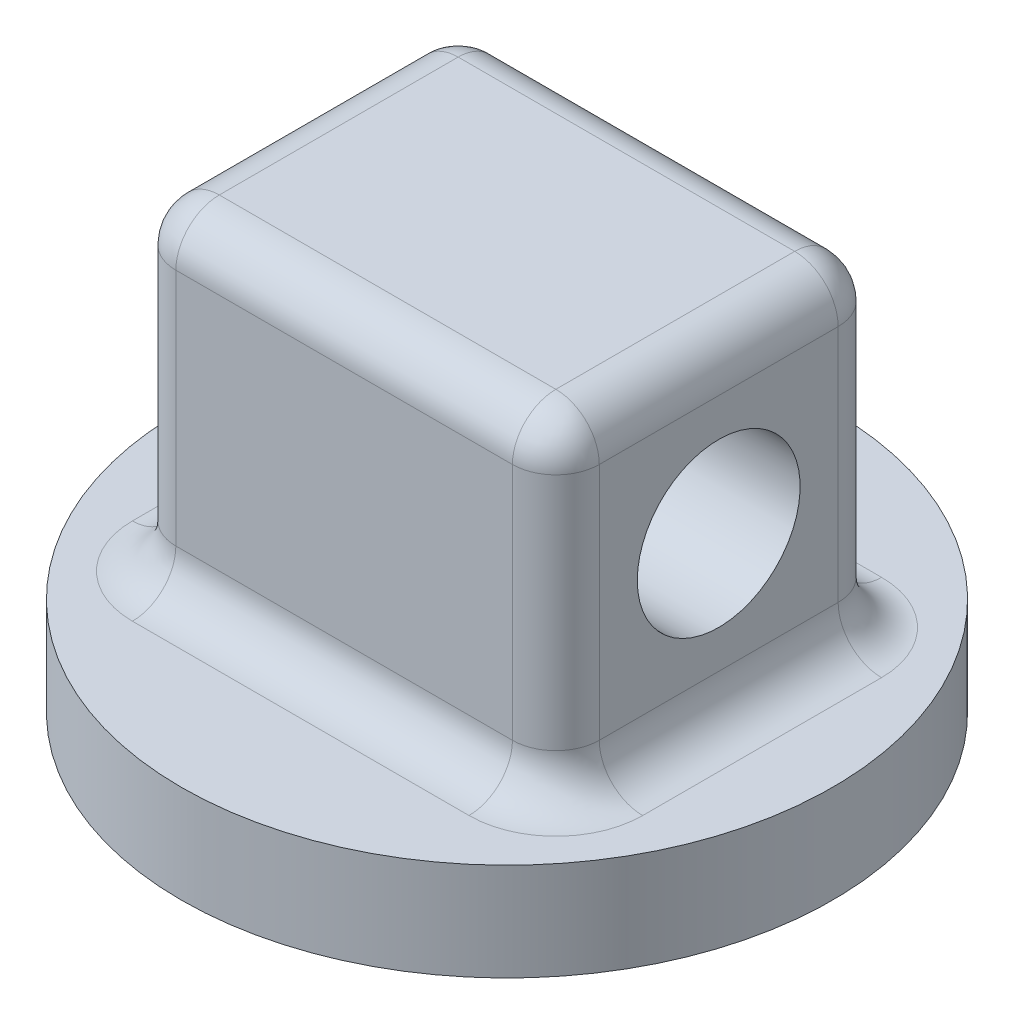
ISO-10303-21;
HEADER;
FILE_DESCRIPTION(('STEP AP214'),'2;1');
FILE_NAME('part.step','',(''),(''),'','','');
FILE_SCHEMA(('AUTOMOTIVE_DESIGN { 1 0 10303 214 1 1 1 1 }'));
ENDSEC;
DATA;
#1=APPLICATION_CONTEXT('core data for automotive mechanical design processes');
#2=APPLICATION_PROTOCOL_DEFINITION('international standard','automotive_design',2000,#1);
#3=PRODUCT_CONTEXT('',#1,'mechanical');
#4=PRODUCT('Part','Part','',(#3));
#5=PRODUCT_RELATED_PRODUCT_CATEGORY('part','',(#4));
#6=PRODUCT_DEFINITION_FORMATION('','',#4);
#7=PRODUCT_DEFINITION_CONTEXT('part definition',#1,'design');
#8=PRODUCT_DEFINITION('design','',#6,#7);
#9=PRODUCT_DEFINITION_SHAPE('','',#8);
#10=(LENGTH_UNIT() NAMED_UNIT(*) SI_UNIT(.MILLI.,.METRE.));
#11=(NAMED_UNIT(*) PLANE_ANGLE_UNIT() SI_UNIT($,.RADIAN.));
#12=(NAMED_UNIT(*) SI_UNIT($,.STERADIAN.) SOLID_ANGLE_UNIT());
#13=UNCERTAINTY_MEASURE_WITH_UNIT(LENGTH_MEASURE(1.E-05),#10,'distance_accuracy_value','');
#14=(GEOMETRIC_REPRESENTATION_CONTEXT(3) GLOBAL_UNCERTAINTY_ASSIGNED_CONTEXT((#13)) GLOBAL_UNIT_ASSIGNED_CONTEXT((#10,
#11,#12)) REPRESENTATION_CONTEXT('',''));
#15=CARTESIAN_POINT('',(0.,0.,0.));
#16=DIRECTION('',(0.,0.,1.));
#17=DIRECTION('',(1.,0.,0.));
#18=AXIS2_PLACEMENT_3D('',#15,#16,#17);
#19=CARTESIAN_POINT('',(0.,-2.11964850831094,0.));
#20=DIRECTION('',(0.,1.,0.));
#21=DIRECTION('',(0.,0.,1.));
#22=AXIS2_PLACEMENT_3D('',#19,#20,#21);
#23=PLANE('',#22);
#24=CARTESIAN_POINT('',(0.,-2.11964850831094,0.));
#25=DIRECTION('',(0.,1.,0.));
#26=DIRECTION('',(0.,0.,1.));
#27=AXIS2_PLACEMENT_3D('',#24,#25,#26);
#28=CIRCLE('',#27,76.2);
#29=CARTESIAN_POINT('',(0.,-2.11964850831094,76.2));
#30=VERTEX_POINT('',#29);
#31=EDGE_CURVE('E179',#30,#30,#28,.T.);
#32=ORIENTED_EDGE('',*,*,#31,.T.);
#33=EDGE_LOOP('',(#32));
#34=FACE_BOUND('',#33,.T.);
#35=CARTESIAN_POINT('',(-39.37,-2.11964850831094,-27.94));
#36=DIRECTION('',(0.,1.,0.));
#37=DIRECTION('',(0.,0.,1.));
#38=AXIS2_PLACEMENT_3D('',#35,#36,#37);
#39=CIRCLE('',#38,20.32);
#40=CARTESIAN_POINT('',(-39.37,-2.11964850831094,-48.26));
#41=VERTEX_POINT('',#40);
#42=CARTESIAN_POINT('',(-59.69,-2.11964850831094,-27.94));
#43=VERTEX_POINT('',#42);
#44=EDGE_CURVE('E308',#41,#43,#39,.T.);
#45=ORIENTED_EDGE('',*,*,#44,.F.);
#46=DIRECTION('',(-1.,0.,0.));
#47=VECTOR('',#46,1.);
#48=CARTESIAN_POINT('',(0.,-2.11964850831094,-48.26));
#49=LINE('',#48,#47);
#50=CARTESIAN_POINT('',(39.37,-2.11964850831094,-48.26));
#51=VERTEX_POINT('',#50);
#52=EDGE_CURVE('E305',#41,#51,#49,.F.);
#53=ORIENTED_EDGE('',*,*,#52,.T.);
#54=CARTESIAN_POINT('',(39.37,-2.11964850831094,-27.94));
#55=DIRECTION('',(0.,1.,0.));
#56=DIRECTION('',(0.,0.,1.));
#57=AXIS2_PLACEMENT_3D('',#54,#55,#56);
#58=CIRCLE('',#57,20.32);
#59=CARTESIAN_POINT('',(59.69,-2.11964850831094,-27.94));
#60=VERTEX_POINT('',#59);
#61=EDGE_CURVE('E301',#60,#51,#58,.T.);
#62=ORIENTED_EDGE('',*,*,#61,.F.);
#63=DIRECTION('',(0.,0.,-1.));
#64=VECTOR('',#63,1.);
#65=CARTESIAN_POINT('',(59.69,-2.11964850831094,0.));
#66=LINE('',#65,#64);
#67=CARTESIAN_POINT('',(59.69,-2.11964850831094,27.94));
#68=VERTEX_POINT('',#67);
#69=EDGE_CURVE('E294',#60,#68,#66,.F.);
#70=ORIENTED_EDGE('',*,*,#69,.T.);
#71=CARTESIAN_POINT('',(39.37,-2.11964850831094,27.94));
#72=DIRECTION('',(0.,1.,0.));
#73=DIRECTION('',(0.,0.,1.));
#74=AXIS2_PLACEMENT_3D('',#71,#72,#73);
#75=CIRCLE('',#74,20.32);
#76=CARTESIAN_POINT('',(39.37,-2.11964850831094,48.26));
#77=VERTEX_POINT('',#76);
#78=EDGE_CURVE('E290',#77,#68,#75,.T.);
#79=ORIENTED_EDGE('',*,*,#78,.F.);
#80=DIRECTION('',(1.,0.,0.));
#81=VECTOR('',#80,1.);
#82=CARTESIAN_POINT('',(0.,-2.11964850831094,48.26));
#83=LINE('',#82,#81);
#84=CARTESIAN_POINT('',(-39.37,-2.11964850831094,48.26));
#85=VERTEX_POINT('',#84);
#86=EDGE_CURVE('E287',#77,#85,#83,.F.);
#87=ORIENTED_EDGE('',*,*,#86,.T.);
#88=CARTESIAN_POINT('',(-39.37,-2.11964850831094,27.94));
#89=DIRECTION('',(0.,1.,0.));
#90=DIRECTION('',(0.,0.,1.));
#91=AXIS2_PLACEMENT_3D('',#88,#89,#90);
#92=CIRCLE('',#91,20.32);
#93=CARTESIAN_POINT('',(-59.69,-2.11964850831094,27.94));
#94=VERTEX_POINT('',#93);
#95=EDGE_CURVE('E283',#94,#85,#92,.T.);
#96=ORIENTED_EDGE('',*,*,#95,.F.);
#97=DIRECTION('',(0.,0.,1.));
#98=VECTOR('',#97,1.);
#99=CARTESIAN_POINT('',(-59.69,-2.11964850831094,0.));
#100=LINE('',#99,#98);
#101=EDGE_CURVE('E297',#94,#43,#100,.F.);
#102=ORIENTED_EDGE('',*,*,#101,.T.);
#103=EDGE_LOOP('',(#45,#53,#62,#70,#79,#87,#96,#102));
#104=FACE_BOUND('',#103,.T.);
#105=ADVANCED_FACE('F54',(#34,#104),#23,.T.);
#106=CARTESIAN_POINT('',(0.,-2.11964850831094,0.));
#107=DIRECTION('',(0.,-1.,0.));
#108=DIRECTION('',(0.,0.,-1.));
#109=AXIS2_PLACEMENT_3D('',#106,#107,#108);
#110=CYLINDRICAL_SURFACE('',#109,76.2);
#111=ORIENTED_EDGE('',*,*,#31,.F.);
#112=EDGE_LOOP('',(#111));
#113=FACE_BOUND('',#112,.T.);
#114=CARTESIAN_POINT('',(0.,-24.9796485083109,0.));
#115=DIRECTION('',(0.,1.,0.));
#116=DIRECTION('',(0.,0.,1.));
#117=AXIS2_PLACEMENT_3D('',#114,#115,#116);
#118=CIRCLE('',#117,76.2);
#119=CARTESIAN_POINT('',(0.,-24.9796485083109,76.2));
#120=VERTEX_POINT('',#119);
#121=EDGE_CURVE('E270',#120,#120,#118,.T.);
#122=ORIENTED_EDGE('',*,*,#121,.T.);
#123=EDGE_LOOP('',(#122));
#124=FACE_BOUND('',#123,.T.);
#125=ADVANCED_FACE('F428',(#113,#124),#110,.T.);
#126=CARTESIAN_POINT('',(0.,-24.9796485083109,0.));
#127=DIRECTION('',(0.,1.,0.));
#128=DIRECTION('',(0.,0.,1.));
#129=AXIS2_PLACEMENT_3D('',#126,#127,#128);
#130=PLANE('',#129);
#131=ORIENTED_EDGE('',*,*,#121,.F.);
#132=EDGE_LOOP('',(#131));
#133=FACE_BOUND('',#132,.T.);
#134=ADVANCED_FACE('F434',(#133),#130,.F.);
#135=CARTESIAN_POINT('',(49.53,74.0803514916891,-38.1));
#136=DIRECTION('',(-1.,0.,0.));
#137=DIRECTION('',(0.,0.,1.));
#138=AXIS2_PLACEMENT_3D('',#135,#136,#137);
#139=PLANE('',#138);
#140=DIRECTION('',(0.,-1.,0.));
#141=VECTOR('',#140,1.);
#142=CARTESIAN_POINT('',(49.53,74.0803514916891,27.94));
#143=LINE('',#142,#141);
#144=CARTESIAN_POINT('',(49.53,63.9203514916891,27.94));
#145=VERTEX_POINT('',#144);
#146=CARTESIAN_POINT('',(49.53,8.04035149168905,27.94));
#147=VERTEX_POINT('',#146);
#148=EDGE_CURVE('E315',#145,#147,#143,.T.);
#149=ORIENTED_EDGE('',*,*,#148,.T.);
#150=DIRECTION('',(0.,0.,-1.));
#151=VECTOR('',#150,1.);
#152=CARTESIAN_POINT('',(49.53,8.04035149168905,-38.1));
#153=LINE('',#152,#151);
#154=CARTESIAN_POINT('',(49.53,8.04035149168905,-27.94));
#155=VERTEX_POINT('',#154);
#156=EDGE_CURVE('E321',#147,#155,#153,.T.);
#157=ORIENTED_EDGE('',*,*,#156,.T.);
#158=DIRECTION('',(0.,-1.,0.));
#159=VECTOR('',#158,1.);
#160=CARTESIAN_POINT('',(49.53,74.0803514916891,-27.94));
#161=LINE('',#160,#159);
#162=CARTESIAN_POINT('',(49.53,63.9203514916891,-27.94));
#163=VERTEX_POINT('',#162);
#164=EDGE_CURVE('E318',#155,#163,#161,.F.);
#165=ORIENTED_EDGE('',*,*,#164,.T.);
#166=DIRECTION('',(0.,0.,-1.));
#167=VECTOR('',#166,1.);
#168=CARTESIAN_POINT('',(49.53,63.9203514916891,38.1));
#169=LINE('',#168,#167);
#170=EDGE_CURVE('E312',#163,#145,#169,.F.);
#171=ORIENTED_EDGE('',*,*,#170,.T.);
#172=EDGE_LOOP('',(#149,#157,#165,#171));
#173=FACE_BOUND('',#172,.T.);
#174=CARTESIAN_POINT('',(49.53,35.980351491689,0.));
#175=DIRECTION('',(-1.,0.,0.));
#176=DIRECTION('',(0.,0.,1.));
#177=AXIS2_PLACEMENT_3D('',#174,#175,#176);
#178=CIRCLE('',#177,19.05);
#179=CARTESIAN_POINT('',(49.53,35.980351491689,19.05));
#180=VERTEX_POINT('',#179);
#181=EDGE_CURVE('E264',#180,#180,#178,.T.);
#182=ORIENTED_EDGE('',*,*,#181,.T.);
#183=EDGE_LOOP('',(#182));
#184=FACE_BOUND('',#183,.T.);
#185=ADVANCED_FACE('F400',(#173,#184),#139,.F.);
#186=CARTESIAN_POINT('',(-49.53,74.0803514916891,-38.1));
#187=DIRECTION('',(0.,0.,1.));
#188=DIRECTION('',(1.,0.,0.));
#189=AXIS2_PLACEMENT_3D('',#186,#187,#188);
#190=PLANE('',#189);
#191=DIRECTION('',(0.,-1.,0.));
#192=VECTOR('',#191,1.);
#193=CARTESIAN_POINT('',(39.37,74.0803514916891,-38.1));
#194=LINE('',#193,#192);
#195=CARTESIAN_POINT('',(39.37,63.9203514916891,-38.1));
#196=VERTEX_POINT('',#195);
#197=CARTESIAN_POINT('',(39.37,8.04035149168905,-38.1));
#198=VERTEX_POINT('',#197);
#199=EDGE_CURVE('E331',#196,#198,#194,.T.);
#200=ORIENTED_EDGE('',*,*,#199,.T.);
#201=DIRECTION('',(-1.,0.,0.));
#202=VECTOR('',#201,1.);
#203=CARTESIAN_POINT('',(-49.53,8.04035149168905,-38.1));
#204=LINE('',#203,#202);
#205=CARTESIAN_POINT('',(-39.37,8.04035149168905,-38.1));
#206=VERTEX_POINT('',#205);
#207=EDGE_CURVE('E335',#198,#206,#204,.T.);
#208=ORIENTED_EDGE('',*,*,#207,.T.);
#209=DIRECTION('',(0.,-1.,0.));
#210=VECTOR('',#209,1.);
#211=CARTESIAN_POINT('',(-39.37,74.0803514916891,-38.1));
#212=LINE('',#211,#210);
#213=CARTESIAN_POINT('',(-39.37,63.9203514916891,-38.1));
#214=VERTEX_POINT('',#213);
#215=EDGE_CURVE('E328',#206,#214,#212,.F.);
#216=ORIENTED_EDGE('',*,*,#215,.T.);
#217=DIRECTION('',(-1.,0.,0.));
#218=VECTOR('',#217,1.);
#219=CARTESIAN_POINT('',(49.53,63.9203514916891,-38.1));
#220=LINE('',#219,#218);
#221=EDGE_CURVE('E325',#214,#196,#220,.F.);
#222=ORIENTED_EDGE('',*,*,#221,.T.);
#223=EDGE_LOOP('',(#200,#208,#216,#222));
#224=FACE_BOUND('',#223,.T.);
#225=ADVANCED_FACE('F444',(#224),#190,.F.);
#226=CARTESIAN_POINT('',(-49.53,74.0803514916891,-38.1));
#227=DIRECTION('',(1.,0.,0.));
#228=DIRECTION('',(0.,0.,-1.));
#229=AXIS2_PLACEMENT_3D('',#226,#227,#228);
#230=PLANE('',#229);
#231=DIRECTION('',(0.,-1.,0.));
#232=VECTOR('',#231,1.);
#233=CARTESIAN_POINT('',(-49.53,74.0803514916891,-27.94));
#234=LINE('',#233,#232);
#235=CARTESIAN_POINT('',(-49.53,63.9203514916891,-27.94));
#236=VERTEX_POINT('',#235);
#237=CARTESIAN_POINT('',(-49.53,8.04035149168905,-27.94));
#238=VERTEX_POINT('',#237);
#239=EDGE_CURVE('E167',#236,#238,#234,.T.);
#240=ORIENTED_EDGE('',*,*,#239,.T.);
#241=DIRECTION('',(0.,0.,1.));
#242=VECTOR('',#241,1.);
#243=CARTESIAN_POINT('',(-49.53,8.04035149168905,-38.1));
#244=LINE('',#243,#242);
#245=CARTESIAN_POINT('',(-49.53,8.04035149168905,27.94));
#246=VERTEX_POINT('',#245);
#247=EDGE_CURVE('E162',#238,#246,#244,.T.);
#248=ORIENTED_EDGE('',*,*,#247,.T.);
#249=DIRECTION('',(0.,-1.,0.));
#250=VECTOR('',#249,1.);
#251=CARTESIAN_POINT('',(-49.53,74.0803514916891,27.94));
#252=LINE('',#251,#250);
#253=CARTESIAN_POINT('',(-49.53,63.9203514916891,27.94));
#254=VERTEX_POINT('',#253);
#255=EDGE_CURVE('E155',#246,#254,#252,.F.);
#256=ORIENTED_EDGE('',*,*,#255,.T.);
#257=DIRECTION('',(0.,0.,1.));
#258=VECTOR('',#257,1.);
#259=CARTESIAN_POINT('',(-49.53,63.9203514916891,-38.1));
#260=LINE('',#259,#258);
#261=EDGE_CURVE('E159',#254,#236,#260,.F.);
#262=ORIENTED_EDGE('',*,*,#261,.T.);
#263=EDGE_LOOP('',(#240,#248,#256,#262));
#264=FACE_BOUND('',#263,.T.);
#265=CARTESIAN_POINT('',(-49.53,35.980351491689,0.));
#266=DIRECTION('',(-1.,0.,0.));
#267=DIRECTION('',(0.,0.,1.));
#268=AXIS2_PLACEMENT_3D('',#265,#266,#267);
#269=CIRCLE('',#268,19.05);
#270=CARTESIAN_POINT('',(-49.53,35.980351491689,19.05));
#271=VERTEX_POINT('',#270);
#272=EDGE_CURVE('E257',#271,#271,#269,.T.);
#273=ORIENTED_EDGE('',*,*,#272,.F.);
#274=EDGE_LOOP('',(#273));
#275=FACE_BOUND('',#274,.T.);
#276=ADVANCED_FACE('F157',(#264,#275),#230,.F.);
#277=CARTESIAN_POINT('',(-49.53,74.0803514916891,38.1));
#278=DIRECTION('',(0.,0.,-1.));
#279=DIRECTION('',(-1.,0.,0.));
#280=AXIS2_PLACEMENT_3D('',#277,#278,#279);
#281=PLANE('',#280);
#282=DIRECTION('',(0.,-1.,0.));
#283=VECTOR('',#282,1.);
#284=CARTESIAN_POINT('',(-39.37,74.0803514916891,38.1));
#285=LINE('',#284,#283);
#286=CARTESIAN_POINT('',(-39.37,63.9203514916891,38.1));
#287=VERTEX_POINT('',#286);
#288=CARTESIAN_POINT('',(-39.37,8.04035149168905,38.1));
#289=VERTEX_POINT('',#288);
#290=EDGE_CURVE('E192',#287,#289,#285,.T.);
#291=ORIENTED_EDGE('',*,*,#290,.T.);
#292=DIRECTION('',(1.,0.,0.));
#293=VECTOR('',#292,1.);
#294=CARTESIAN_POINT('',(-49.53,8.04035149168905,38.1));
#295=LINE('',#294,#293);
#296=CARTESIAN_POINT('',(39.37,8.04035149168905,38.1));
#297=VERTEX_POINT('',#296);
#298=EDGE_CURVE('E346',#289,#297,#295,.T.);
#299=ORIENTED_EDGE('',*,*,#298,.T.);
#300=DIRECTION('',(0.,-1.,0.));
#301=VECTOR('',#300,1.);
#302=CARTESIAN_POINT('',(39.37,74.0803514916891,38.1));
#303=LINE('',#302,#301);
#304=CARTESIAN_POINT('',(39.37,63.9203514916891,38.1));
#305=VERTEX_POINT('',#304);
#306=EDGE_CURVE('E341',#297,#305,#303,.F.);
#307=ORIENTED_EDGE('',*,*,#306,.T.);
#308=DIRECTION('',(1.,0.,0.));
#309=VECTOR('',#308,1.);
#310=CARTESIAN_POINT('',(-49.53,63.9203514916891,38.1));
#311=LINE('',#310,#309);
#312=EDGE_CURVE('E338',#305,#287,#311,.F.);
#313=ORIENTED_EDGE('',*,*,#312,.T.);
#314=EDGE_LOOP('',(#291,#299,#307,#313));
#315=FACE_BOUND('',#314,.T.);
#316=ADVANCED_FACE('F454',(#315),#281,.F.);
#317=CARTESIAN_POINT('',(0.,74.0803514916891,0.));
#318=DIRECTION('',(0.,1.,0.));
#319=DIRECTION('',(0.,0.,1.));
#320=AXIS2_PLACEMENT_3D('',#317,#318,#319);
#321=PLANE('',#320);
#322=DIRECTION('',(0.,0.,1.));
#323=VECTOR('',#322,1.);
#324=CARTESIAN_POINT('',(-39.37,74.0803514916891,38.1));
#325=LINE('',#324,#323);
#326=CARTESIAN_POINT('',(-39.37,74.0803514916891,-27.94));
#327=VERTEX_POINT('',#326);
#328=CARTESIAN_POINT('',(-39.37,74.0803514916891,27.94));
#329=VERTEX_POINT('',#328);
#330=EDGE_CURVE('E64',#327,#329,#325,.T.);
#331=ORIENTED_EDGE('',*,*,#330,.T.);
#332=DIRECTION('',(1.,0.,0.));
#333=VECTOR('',#332,1.);
#334=CARTESIAN_POINT('',(49.53,74.0803514916891,27.94));
#335=LINE('',#334,#333);
#336=CARTESIAN_POINT('',(39.37,74.0803514916891,27.94));
#337=VERTEX_POINT('',#336);
#338=EDGE_CURVE('E13',#329,#337,#335,.T.);
#339=ORIENTED_EDGE('',*,*,#338,.T.);
#340=DIRECTION('',(0.,0.,-1.));
#341=VECTOR('',#340,1.);
#342=CARTESIAN_POINT('',(39.37,74.0803514916891,-38.1));
#343=LINE('',#342,#341);
#344=CARTESIAN_POINT('',(39.37,74.0803514916891,-27.94));
#345=VERTEX_POINT('',#344);
#346=EDGE_CURVE('E349',#337,#345,#343,.T.);
#347=ORIENTED_EDGE('',*,*,#346,.T.);
#348=DIRECTION('',(-1.,0.,0.));
#349=VECTOR('',#348,1.);
#350=CARTESIAN_POINT('',(-49.53,74.0803514916891,-27.94));
#351=LINE('',#350,#349);
#352=EDGE_CURVE('E75',#345,#327,#351,.T.);
#353=ORIENTED_EDGE('',*,*,#352,.T.);
#354=EDGE_LOOP('',(#331,#339,#347,#353));
#355=FACE_BOUND('',#354,.T.);
#356=ADVANCED_FACE('F459',(#355),#321,.T.);
#357=CARTESIAN_POINT('',(76.2,35.980351491689,0.));
#358=DIRECTION('',(-1.,0.,0.));
#359=DIRECTION('',(0.,0.,1.));
#360=AXIS2_PLACEMENT_3D('',#357,#358,#359);
#361=CYLINDRICAL_SURFACE('',#360,19.05);
#362=ORIENTED_EDGE('',*,*,#272,.T.);
#363=EDGE_LOOP('',(#362));
#364=FACE_BOUND('',#363,.T.);
#365=ORIENTED_EDGE('',*,*,#181,.F.);
#366=EDGE_LOOP('',(#365));
#367=FACE_BOUND('',#366,.T.);
#368=ADVANCED_FACE('F463',(#364,#367),#361,.F.);
#369=CARTESIAN_POINT('',(39.37,63.9203514916891,0.));
#370=DIRECTION('',(0.,0.,1.));
#371=DIRECTION('',(1.,0.,0.));
#372=AXIS2_PLACEMENT_3D('',#369,#370,#371);
#373=CYLINDRICAL_SURFACE('',#372,10.16);
#374=CARTESIAN_POINT('',(39.37,63.9203514916891,-27.94));
#375=DIRECTION('',(0.,0.,-1.));
#376=DIRECTION('',(-1.,0.,0.));
#377=AXIS2_PLACEMENT_3D('',#374,#375,#376);
#378=CIRCLE('',#377,10.16);
#379=EDGE_CURVE('E58',#345,#163,#378,.T.);
#380=ORIENTED_EDGE('',*,*,#379,.F.);
#381=ORIENTED_EDGE('',*,*,#346,.F.);
#382=CARTESIAN_POINT('',(39.37,63.9203514916891,27.94));
#383=DIRECTION('',(0.,0.,1.));
#384=DIRECTION('',(0.,-1.,0.));
#385=AXIS2_PLACEMENT_3D('',#382,#383,#384);
#386=CIRCLE('',#385,10.16);
#387=EDGE_CURVE('E247',#145,#337,#386,.T.);
#388=ORIENTED_EDGE('',*,*,#387,.F.);
#389=ORIENTED_EDGE('',*,*,#170,.F.);
#390=EDGE_LOOP('',(#380,#381,#388,#389));
#391=FACE_BOUND('',#390,.T.);
#392=ADVANCED_FACE('F56',(#391),#373,.T.);
#393=CARTESIAN_POINT('',(39.37,63.9203514916891,-27.94));
#394=DIRECTION('',(1.,0.,0.));
#395=DIRECTION('',(0.,0.,-1.));
#396=AXIS2_PLACEMENT_3D('',#393,#394,#395);
#397=SPHERICAL_SURFACE('',#396,10.16);
#398=CARTESIAN_POINT('',(39.37,63.9203514916891,-27.94));
#399=DIRECTION('',(1.,0.,0.));
#400=DIRECTION('',(0.,1.,0.));
#401=AXIS2_PLACEMENT_3D('',#398,#399,#400);
#402=CIRCLE('',#401,10.16);
#403=EDGE_CURVE('E240',#345,#196,#402,.F.);
#404=ORIENTED_EDGE('',*,*,#403,.F.);
#405=ORIENTED_EDGE('',*,*,#379,.T.);
#406=CARTESIAN_POINT('',(39.37,63.9203514916891,-27.94));
#407=DIRECTION('',(0.,1.,0.));
#408=DIRECTION('',(0.,0.,1.));
#409=AXIS2_PLACEMENT_3D('',#406,#407,#408);
#410=CIRCLE('',#409,10.16);
#411=EDGE_CURVE('E244',#196,#163,#410,.F.);
#412=ORIENTED_EDGE('',*,*,#411,.F.);
#413=EDGE_LOOP('',(#404,#405,#412));
#414=FACE_BOUND('',#413,.T.);
#415=ADVANCED_FACE('F468',(#414),#397,.T.);
#416=CARTESIAN_POINT('',(39.37,63.9203514916891,27.94));
#417=DIRECTION('',(0.,1.,0.));
#418=DIRECTION('',(0.,0.,1.));
#419=AXIS2_PLACEMENT_3D('',#416,#417,#418);
#420=SPHERICAL_SURFACE('',#419,10.16);
#421=CARTESIAN_POINT('',(39.37,63.9203514916891,27.94));
#422=DIRECTION('',(0.,1.,0.));
#423=DIRECTION('',(0.,0.,1.));
#424=AXIS2_PLACEMENT_3D('',#421,#422,#423);
#425=CIRCLE('',#424,10.16);
#426=EDGE_CURVE('E233',#145,#305,#425,.F.);
#427=ORIENTED_EDGE('',*,*,#426,.F.);
#428=ORIENTED_EDGE('',*,*,#387,.T.);
#429=CARTESIAN_POINT('',(39.37,63.9203514916891,27.94));
#430=DIRECTION('',(1.,0.,0.));
#431=DIRECTION('',(0.,0.,-1.));
#432=AXIS2_PLACEMENT_3D('',#429,#430,#431);
#433=CIRCLE('',#432,10.16);
#434=EDGE_CURVE('E237',#305,#337,#433,.F.);
#435=ORIENTED_EDGE('',*,*,#434,.F.);
#436=EDGE_LOOP('',(#427,#428,#435));
#437=FACE_BOUND('',#436,.T.);
#438=ADVANCED_FACE('F475',(#437),#420,.T.);
#439=CARTESIAN_POINT('',(39.37,74.0803514916891,-27.94));
#440=DIRECTION('',(0.,-1.,0.));
#441=DIRECTION('',(0.,0.,-1.));
#442=AXIS2_PLACEMENT_3D('',#439,#440,#441);
#443=CYLINDRICAL_SURFACE('',#442,10.16);
#444=ORIENTED_EDGE('',*,*,#411,.T.);
#445=ORIENTED_EDGE('',*,*,#164,.F.);
#446=CARTESIAN_POINT('',(39.37,8.04035149168905,-27.94));
#447=DIRECTION('',(0.,1.,0.));
#448=DIRECTION('',(0.,0.,1.));
#449=AXIS2_PLACEMENT_3D('',#446,#447,#448);
#450=CIRCLE('',#449,10.16);
#451=EDGE_CURVE('E226',#198,#155,#450,.F.);
#452=ORIENTED_EDGE('',*,*,#451,.F.);
#453=ORIENTED_EDGE('',*,*,#199,.F.);
#454=EDGE_LOOP('',(#444,#445,#452,#453));
#455=FACE_BOUND('',#454,.T.);
#456=ADVANCED_FACE('F396',(#455),#443,.T.);
#457=CARTESIAN_POINT('',(0.,63.9203514916891,-27.94));
#458=DIRECTION('',(1.,0.,0.));
#459=DIRECTION('',(0.,0.,-1.));
#460=AXIS2_PLACEMENT_3D('',#457,#458,#459);
#461=CYLINDRICAL_SURFACE('',#460,10.16);
#462=ORIENTED_EDGE('',*,*,#403,.T.);
#463=ORIENTED_EDGE('',*,*,#221,.F.);
#464=CARTESIAN_POINT('',(-39.37,63.9203514916891,-27.94));
#465=DIRECTION('',(-1.,0.,0.));
#466=DIRECTION('',(0.,0.,1.));
#467=AXIS2_PLACEMENT_3D('',#464,#465,#466);
#468=CIRCLE('',#467,10.16);
#469=EDGE_CURVE('E222',#327,#214,#468,.T.);
#470=ORIENTED_EDGE('',*,*,#469,.F.);
#471=ORIENTED_EDGE('',*,*,#352,.F.);
#472=EDGE_LOOP('',(#462,#463,#470,#471));
#473=FACE_BOUND('',#472,.T.);
#474=ADVANCED_FACE('F479',(#473),#461,.T.);
#475=CARTESIAN_POINT('',(-39.37,63.9203514916891,0.));
#476=DIRECTION('',(0.,0.,-1.));
#477=DIRECTION('',(-1.,0.,0.));
#478=AXIS2_PLACEMENT_3D('',#475,#476,#477);
#479=CYLINDRICAL_SURFACE('',#478,10.16);
#480=CARTESIAN_POINT('',(-39.37,63.9203514916891,27.94));
#481=DIRECTION('',(0.,0.,1.));
#482=DIRECTION('',(1.,0.,0.));
#483=AXIS2_PLACEMENT_3D('',#480,#481,#482);
#484=CIRCLE('',#483,10.16);
#485=EDGE_CURVE('E173',#329,#254,#484,.T.);
#486=ORIENTED_EDGE('',*,*,#485,.F.);
#487=ORIENTED_EDGE('',*,*,#330,.F.);
#488=CARTESIAN_POINT('',(-39.37,63.9203514916891,-27.94));
#489=DIRECTION('',(0.,0.,-1.));
#490=DIRECTION('',(-1.,0.,0.));
#491=AXIS2_PLACEMENT_3D('',#488,#489,#490);
#492=CIRCLE('',#491,10.16);
#493=EDGE_CURVE('E176',#236,#327,#492,.T.);
#494=ORIENTED_EDGE('',*,*,#493,.F.);
#495=ORIENTED_EDGE('',*,*,#261,.F.);
#496=EDGE_LOOP('',(#486,#487,#494,#495));
#497=FACE_BOUND('',#496,.T.);
#498=ADVANCED_FACE('F172',(#497),#479,.T.);
#499=CARTESIAN_POINT('',(0.,63.9203514916891,27.94));
#500=DIRECTION('',(-1.,0.,0.));
#501=DIRECTION('',(0.,0.,1.));
#502=AXIS2_PLACEMENT_3D('',#499,#500,#501);
#503=CYLINDRICAL_SURFACE('',#502,10.16);
#504=ORIENTED_EDGE('',*,*,#434,.T.);
#505=ORIENTED_EDGE('',*,*,#338,.F.);
#506=CARTESIAN_POINT('',(-39.37,63.9203514916891,27.94));
#507=DIRECTION('',(-1.,0.,0.));
#508=DIRECTION('',(0.,-1.,0.));
#509=AXIS2_PLACEMENT_3D('',#506,#507,#508);
#510=CIRCLE('',#509,10.16);
#511=EDGE_CURVE('E187',#287,#329,#510,.T.);
#512=ORIENTED_EDGE('',*,*,#511,.F.);
#513=ORIENTED_EDGE('',*,*,#312,.F.);
#514=EDGE_LOOP('',(#504,#505,#512,#513));
#515=FACE_BOUND('',#514,.T.);
#516=ADVANCED_FACE('F508',(#515),#503,.T.);
#517=CARTESIAN_POINT('',(39.37,74.0803514916891,27.94));
#518=DIRECTION('',(0.,-1.,0.));
#519=DIRECTION('',(0.,0.,-1.));
#520=AXIS2_PLACEMENT_3D('',#517,#518,#519);
#521=CYLINDRICAL_SURFACE('',#520,10.16);
#522=ORIENTED_EDGE('',*,*,#426,.T.);
#523=ORIENTED_EDGE('',*,*,#306,.F.);
#524=CARTESIAN_POINT('',(39.37,8.04035149168905,27.94));
#525=DIRECTION('',(0.,1.,0.));
#526=DIRECTION('',(0.,0.,1.));
#527=AXIS2_PLACEMENT_3D('',#524,#525,#526);
#528=CIRCLE('',#527,10.16);
#529=EDGE_CURVE('E214',#147,#297,#528,.F.);
#530=ORIENTED_EDGE('',*,*,#529,.F.);
#531=ORIENTED_EDGE('',*,*,#148,.F.);
#532=EDGE_LOOP('',(#522,#523,#530,#531));
#533=FACE_BOUND('',#532,.T.);
#534=ADVANCED_FACE('F404',(#533),#521,.T.);
#535=CARTESIAN_POINT('',(59.69,8.04035149168905,-38.1));
#536=DIRECTION('',(0.,0.,-1.));
#537=DIRECTION('',(-1.,0.,0.));
#538=AXIS2_PLACEMENT_3D('',#535,#536,#537);
#539=CYLINDRICAL_SURFACE('',#538,10.16);
#540=CARTESIAN_POINT('',(59.69,8.04035149168906,27.94));
#541=DIRECTION('',(0.,0.,-1.));
#542=DIRECTION('',(-1.,0.,0.));
#543=AXIS2_PLACEMENT_3D('',#540,#541,#542);
#544=CIRCLE('',#543,10.16);
#545=EDGE_CURVE('E210',#68,#147,#544,.T.);
#546=ORIENTED_EDGE('',*,*,#545,.F.);
#547=ORIENTED_EDGE('',*,*,#69,.F.);
#548=CARTESIAN_POINT('',(59.69,8.04035149168905,-27.94));
#549=DIRECTION('',(0.,0.,1.));
#550=DIRECTION('',(1.,0.,0.));
#551=AXIS2_PLACEMENT_3D('',#548,#549,#550);
#552=CIRCLE('',#551,10.16);
#553=EDGE_CURVE('E229',#155,#60,#552,.T.);
#554=ORIENTED_EDGE('',*,*,#553,.F.);
#555=ORIENTED_EDGE('',*,*,#156,.F.);
#556=EDGE_LOOP('',(#546,#547,#554,#555));
#557=FACE_BOUND('',#556,.T.);
#558=ADVANCED_FACE('F393',(#557),#539,.F.);
#559=CARTESIAN_POINT('',(39.37,8.04035149168905,-27.94));
#560=DIRECTION('',(0.,1.,0.));
#561=DIRECTION('',(0.,0.,1.));
#562=AXIS2_PLACEMENT_3D('',#559,#560,#561);
#563=TOROIDAL_SURFACE('',#562,20.32,10.16);
#564=ORIENTED_EDGE('',*,*,#553,.T.);
#565=ORIENTED_EDGE('',*,*,#61,.T.);
#566=CARTESIAN_POINT('',(39.37,8.04035149168906,-48.26));
#567=DIRECTION('',(-1.,0.,0.));
#568=DIRECTION('',(0.,0.,1.));
#569=AXIS2_PLACEMENT_3D('',#566,#567,#568);
#570=CIRCLE('',#569,10.16);
#571=EDGE_CURVE('E200',#198,#51,#570,.F.);
#572=ORIENTED_EDGE('',*,*,#571,.F.);
#573=ORIENTED_EDGE('',*,*,#451,.T.);
#574=EDGE_LOOP('',(#564,#565,#572,#573));
#575=FACE_BOUND('',#574,.T.);
#576=ADVANCED_FACE('F386',(#575),#563,.F.);
#577=CARTESIAN_POINT('',(-39.37,63.9203514916891,-27.94));
#578=DIRECTION('',(0.,1.,0.));
#579=DIRECTION('',(-1.,0.,0.));
#580=AXIS2_PLACEMENT_3D('',#577,#578,#579);
#581=SPHERICAL_SURFACE('',#580,10.16);
#582=ORIENTED_EDGE('',*,*,#493,.T.);
#583=ORIENTED_EDGE('',*,*,#469,.T.);
#584=CARTESIAN_POINT('',(-39.37,63.9203514916891,-27.94));
#585=DIRECTION('',(0.,1.,0.));
#586=DIRECTION('',(0.,0.,1.));
#587=AXIS2_PLACEMENT_3D('',#584,#585,#586);
#588=CIRCLE('',#587,10.16);
#589=EDGE_CURVE('E194',#236,#214,#588,.F.);
#590=ORIENTED_EDGE('',*,*,#589,.F.);
#591=EDGE_LOOP('',(#582,#583,#590));
#592=FACE_BOUND('',#591,.T.);
#593=ADVANCED_FACE('F481',(#592),#581,.T.);
#594=CARTESIAN_POINT('',(-39.37,63.9203514916891,27.94));
#595=DIRECTION('',(0.,1.,0.));
#596=DIRECTION('',(-1.,0.,0.));
#597=AXIS2_PLACEMENT_3D('',#594,#595,#596);
#598=SPHERICAL_SURFACE('',#597,10.16);
#599=ORIENTED_EDGE('',*,*,#511,.T.);
#600=ORIENTED_EDGE('',*,*,#485,.T.);
#601=CARTESIAN_POINT('',(-39.37,63.9203514916891,27.94));
#602=DIRECTION('',(0.,1.,0.));
#603=DIRECTION('',(0.,0.,1.));
#604=AXIS2_PLACEMENT_3D('',#601,#602,#603);
#605=CIRCLE('',#604,10.16);
#606=EDGE_CURVE('E184',#287,#254,#605,.F.);
#607=ORIENTED_EDGE('',*,*,#606,.F.);
#608=EDGE_LOOP('',(#599,#600,#607));
#609=FACE_BOUND('',#608,.T.);
#610=ADVANCED_FACE('F183',(#609),#598,.T.);
#611=CARTESIAN_POINT('',(39.37,8.04035149168905,27.94));
#612=DIRECTION('',(0.,1.,0.));
#613=DIRECTION('',(0.,0.,1.));
#614=AXIS2_PLACEMENT_3D('',#611,#612,#613);
#615=TOROIDAL_SURFACE('',#614,20.32,10.16);
#616=ORIENTED_EDGE('',*,*,#545,.T.);
#617=ORIENTED_EDGE('',*,*,#529,.T.);
#618=CARTESIAN_POINT('',(39.37,8.04035149168905,48.26));
#619=DIRECTION('',(-1.,0.,0.));
#620=DIRECTION('',(0.,0.,1.));
#621=AXIS2_PLACEMENT_3D('',#618,#619,#620);
#622=CIRCLE('',#621,10.16);
#623=EDGE_CURVE('E195',#77,#297,#622,.F.);
#624=ORIENTED_EDGE('',*,*,#623,.F.);
#625=ORIENTED_EDGE('',*,*,#78,.T.);
#626=EDGE_LOOP('',(#616,#617,#624,#625));
#627=FACE_BOUND('',#626,.T.);
#628=ADVANCED_FACE('F408',(#627),#615,.F.);
#629=CARTESIAN_POINT('',(-49.53,8.04035149168905,-48.26));
#630=DIRECTION('',(-1.,0.,0.));
#631=DIRECTION('',(0.,0.,1.));
#632=AXIS2_PLACEMENT_3D('',#629,#630,#631);
#633=CYLINDRICAL_SURFACE('',#632,10.16);
#634=ORIENTED_EDGE('',*,*,#571,.T.);
#635=ORIENTED_EDGE('',*,*,#52,.F.);
#636=CARTESIAN_POINT('',(-39.37,8.04035149168905,-48.26));
#637=DIRECTION('',(1.,0.,0.));
#638=DIRECTION('',(0.,0.,-1.));
#639=AXIS2_PLACEMENT_3D('',#636,#637,#638);
#640=CIRCLE('',#639,10.16);
#641=EDGE_CURVE('E203',#206,#41,#640,.T.);
#642=ORIENTED_EDGE('',*,*,#641,.F.);
#643=ORIENTED_EDGE('',*,*,#207,.F.);
#644=EDGE_LOOP('',(#634,#635,#642,#643));
#645=FACE_BOUND('',#644,.T.);
#646=ADVANCED_FACE('F381',(#645),#633,.F.);
#647=CARTESIAN_POINT('',(-39.37,74.0803514916891,-27.94));
#648=DIRECTION('',(0.,-1.,0.));
#649=DIRECTION('',(0.,0.,-1.));
#650=AXIS2_PLACEMENT_3D('',#647,#648,#649);
#651=CYLINDRICAL_SURFACE('',#650,10.16);
#652=ORIENTED_EDGE('',*,*,#589,.T.);
#653=ORIENTED_EDGE('',*,*,#215,.F.);
#654=CARTESIAN_POINT('',(-39.37,8.04035149168905,-27.94));
#655=DIRECTION('',(0.,1.,0.));
#656=DIRECTION('',(0.,0.,1.));
#657=AXIS2_PLACEMENT_3D('',#654,#655,#656);
#658=CIRCLE('',#657,10.16);
#659=EDGE_CURVE('E369',#238,#206,#658,.F.);
#660=ORIENTED_EDGE('',*,*,#659,.F.);
#661=ORIENTED_EDGE('',*,*,#239,.F.);
#662=EDGE_LOOP('',(#652,#653,#660,#661));
#663=FACE_BOUND('',#662,.T.);
#664=ADVANCED_FACE('F485',(#663),#651,.T.);
#665=CARTESIAN_POINT('',(-39.37,74.0803514916891,27.94));
#666=DIRECTION('',(0.,-1.,0.));
#667=DIRECTION('',(0.,0.,-1.));
#668=AXIS2_PLACEMENT_3D('',#665,#666,#667);
#669=CYLINDRICAL_SURFACE('',#668,10.16);
#670=ORIENTED_EDGE('',*,*,#606,.T.);
#671=ORIENTED_EDGE('',*,*,#255,.F.);
#672=CARTESIAN_POINT('',(-39.37,8.04035149168905,27.94));
#673=DIRECTION('',(0.,1.,0.));
#674=DIRECTION('',(0.,0.,1.));
#675=AXIS2_PLACEMENT_3D('',#672,#673,#674);
#676=CIRCLE('',#675,10.16);
#677=EDGE_CURVE('E365',#289,#246,#676,.F.);
#678=ORIENTED_EDGE('',*,*,#677,.F.);
#679=ORIENTED_EDGE('',*,*,#290,.F.);
#680=EDGE_LOOP('',(#670,#671,#678,#679));
#681=FACE_BOUND('',#680,.T.);
#682=ADVANCED_FACE('F190',(#681),#669,.T.);
#683=CARTESIAN_POINT('',(-49.53,8.04035149168905,48.26));
#684=DIRECTION('',(1.,0.,0.));
#685=DIRECTION('',(0.,0.,-1.));
#686=AXIS2_PLACEMENT_3D('',#683,#684,#685);
#687=CYLINDRICAL_SURFACE('',#686,10.16);
#688=ORIENTED_EDGE('',*,*,#623,.T.);
#689=ORIENTED_EDGE('',*,*,#298,.F.);
#690=CARTESIAN_POINT('',(-39.37,8.04035149168906,48.26));
#691=DIRECTION('',(1.,0.,0.));
#692=DIRECTION('',(0.,0.,-1.));
#693=AXIS2_PLACEMENT_3D('',#690,#691,#692);
#694=CIRCLE('',#693,10.16);
#695=EDGE_CURVE('E362',#85,#289,#694,.T.);
#696=ORIENTED_EDGE('',*,*,#695,.F.);
#697=ORIENTED_EDGE('',*,*,#86,.F.);
#698=EDGE_LOOP('',(#688,#689,#696,#697));
#699=FACE_BOUND('',#698,.T.);
#700=ADVANCED_FACE('F414',(#699),#687,.F.);
#701=CARTESIAN_POINT('',(-39.37,8.04035149168905,-27.94));
#702=DIRECTION('',(0.,1.,0.));
#703=DIRECTION('',(0.,0.,1.));
#704=AXIS2_PLACEMENT_3D('',#701,#702,#703);
#705=TOROIDAL_SURFACE('',#704,20.32,10.16);
#706=ORIENTED_EDGE('',*,*,#641,.T.);
#707=ORIENTED_EDGE('',*,*,#44,.T.);
#708=CARTESIAN_POINT('',(-59.69,8.04035149168906,-27.94));
#709=DIRECTION('',(0.,0.,1.));
#710=DIRECTION('',(1.,0.,0.));
#711=AXIS2_PLACEMENT_3D('',#708,#709,#710);
#712=CIRCLE('',#711,10.16);
#713=EDGE_CURVE('E359',#238,#43,#712,.F.);
#714=ORIENTED_EDGE('',*,*,#713,.F.);
#715=ORIENTED_EDGE('',*,*,#659,.T.);
#716=EDGE_LOOP('',(#706,#707,#714,#715));
#717=FACE_BOUND('',#716,.T.);
#718=ADVANCED_FACE('F376',(#717),#705,.F.);
#719=CARTESIAN_POINT('',(-39.37,8.04035149168905,27.94));
#720=DIRECTION('',(0.,1.,0.));
#721=DIRECTION('',(0.,0.,1.));
#722=AXIS2_PLACEMENT_3D('',#719,#720,#721);
#723=TOROIDAL_SURFACE('',#722,20.32,10.16);
#724=ORIENTED_EDGE('',*,*,#695,.T.);
#725=ORIENTED_EDGE('',*,*,#677,.T.);
#726=CARTESIAN_POINT('',(-59.69,8.04035149168905,27.94));
#727=DIRECTION('',(0.,0.,-1.));
#728=DIRECTION('',(-1.,0.,0.));
#729=AXIS2_PLACEMENT_3D('',#726,#727,#728);
#730=CIRCLE('',#729,10.16);
#731=EDGE_CURVE('E356',#94,#246,#730,.F.);
#732=ORIENTED_EDGE('',*,*,#731,.F.);
#733=ORIENTED_EDGE('',*,*,#95,.T.);
#734=EDGE_LOOP('',(#724,#725,#732,#733));
#735=FACE_BOUND('',#734,.T.);
#736=ADVANCED_FACE('F417',(#735),#723,.F.);
#737=CARTESIAN_POINT('',(-59.69,8.04035149168905,-38.1));
#738=DIRECTION('',(0.,0.,1.));
#739=DIRECTION('',(1.,0.,0.));
#740=AXIS2_PLACEMENT_3D('',#737,#738,#739);
#741=CYLINDRICAL_SURFACE('',#740,10.16);
#742=ORIENTED_EDGE('',*,*,#713,.T.);
#743=ORIENTED_EDGE('',*,*,#101,.F.);
#744=ORIENTED_EDGE('',*,*,#731,.T.);
#745=ORIENTED_EDGE('',*,*,#247,.F.);
#746=EDGE_LOOP('',(#742,#743,#744,#745));
#747=FACE_BOUND('',#746,.T.);
#748=ADVANCED_FACE('F419',(#747),#741,.F.);
#749=CLOSED_SHELL('',(#105,#125,#134,#185,#225,#276,#316,#356,#368,#392,#415,#438,#456,#474,
#498,#516,#534,#558,#576,#593,#610,#628,#646,#664,#682,#700,#718,#736,#748));
#750=MANIFOLD_SOLID_BREP('B2',#749);
#751=ADVANCED_BREP_SHAPE_REPRESENTATION('',(#18,#750),#14);
#752=SHAPE_DEFINITION_REPRESENTATION(#9,#751);
ENDSEC;
END-ISO-10303-21;
